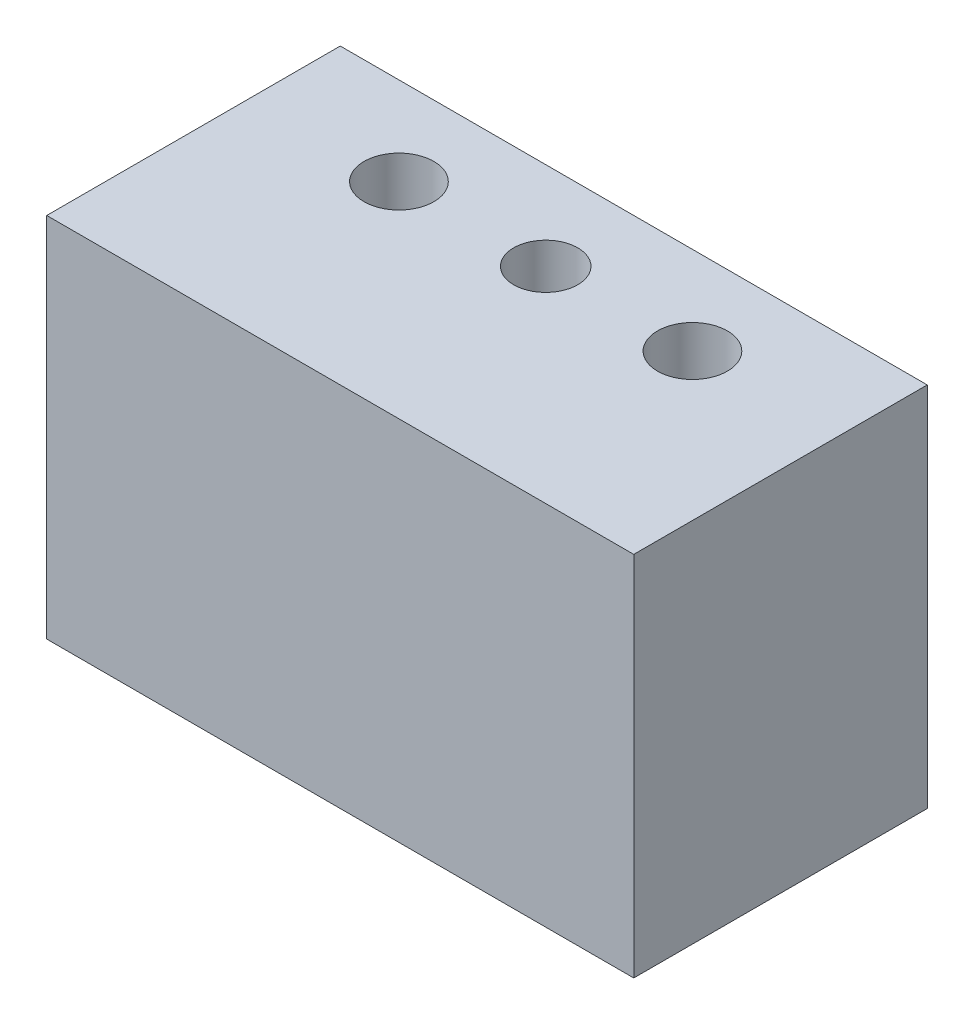
ISO-10303-21;
HEADER;
FILE_DESCRIPTION(('STEP AP214'),'2;1');
FILE_NAME('part.step','',(''),(''),'','','');
FILE_SCHEMA(('AUTOMOTIVE_DESIGN { 1 0 10303 214 1 1 1 1 }'));
ENDSEC;
DATA;
#1=APPLICATION_CONTEXT('core data for automotive mechanical design processes');
#2=APPLICATION_PROTOCOL_DEFINITION('international standard','automotive_design',2000,#1);
#3=PRODUCT_CONTEXT('',#1,'mechanical');
#4=PRODUCT('Part','Part','',(#3));
#5=PRODUCT_RELATED_PRODUCT_CATEGORY('part','',(#4));
#6=PRODUCT_DEFINITION_FORMATION('','',#4);
#7=PRODUCT_DEFINITION_CONTEXT('part definition',#1,'design');
#8=PRODUCT_DEFINITION('design','',#6,#7);
#9=PRODUCT_DEFINITION_SHAPE('','',#8);
#10=(LENGTH_UNIT() NAMED_UNIT(*) SI_UNIT(.MILLI.,.METRE.));
#11=(NAMED_UNIT(*) PLANE_ANGLE_UNIT() SI_UNIT($,.RADIAN.));
#12=(NAMED_UNIT(*) SI_UNIT($,.STERADIAN.) SOLID_ANGLE_UNIT());
#13=UNCERTAINTY_MEASURE_WITH_UNIT(LENGTH_MEASURE(1.E-05),#10,'distance_accuracy_value','');
#14=(GEOMETRIC_REPRESENTATION_CONTEXT(3) GLOBAL_UNCERTAINTY_ASSIGNED_CONTEXT((#13)) GLOBAL_UNIT_ASSIGNED_CONTEXT((#10,
#11,#12)) REPRESENTATION_CONTEXT('',''));
#15=CARTESIAN_POINT('',(0.,0.,0.));
#16=DIRECTION('',(0.,0.,1.));
#17=DIRECTION('',(1.,0.,0.));
#18=AXIS2_PLACEMENT_3D('',#15,#16,#17);
#19=CARTESIAN_POINT('',(0.,25.,0.));
#20=DIRECTION('',(0.,-1.,0.));
#21=DIRECTION('',(0.,0.,-1.));
#22=AXIS2_PLACEMENT_3D('',#19,#20,#21);
#23=PLANE('',#22);
#24=CARTESIAN_POINT('',(20.,25.,-14.));
#25=DIRECTION('',(0.,1.,0.));
#26=DIRECTION('',(0.,0.,1.));
#27=AXIS2_PLACEMENT_3D('',#24,#25,#26);
#28=CIRCLE('',#27,2.18287599999999);
#29=CARTESIAN_POINT('',(20.,25.,-11.817124));
#30=VERTEX_POINT('',#29);
#31=EDGE_CURVE('E128',#30,#30,#28,.T.);
#32=ORIENTED_EDGE('',*,*,#31,.F.);
#33=EDGE_LOOP('',(#32));
#34=FACE_BOUND('',#33,.T.);
#35=CARTESIAN_POINT('',(10.,25.,-14.));
#36=DIRECTION('',(0.,1.,0.));
#37=DIRECTION('',(0.,0.,1.));
#38=AXIS2_PLACEMENT_3D('',#35,#36,#37);
#39=CIRCLE('',#38,2.38);
#40=CARTESIAN_POINT('',(10.,25.,-11.62));
#41=VERTEX_POINT('',#40);
#42=EDGE_CURVE('E102',#41,#41,#39,.T.);
#43=ORIENTED_EDGE('',*,*,#42,.F.);
#44=EDGE_LOOP('',(#43));
#45=FACE_BOUND('',#44,.T.);
#46=DIRECTION('',(0.,0.,1.));
#47=VECTOR('',#46,1.);
#48=CARTESIAN_POINT('',(0.,25.,0.));
#49=LINE('',#48,#47);
#50=CARTESIAN_POINT('',(0.,25.,-20.));
#51=VERTEX_POINT('',#50);
#52=CARTESIAN_POINT('',(0.,25.,0.));
#53=VERTEX_POINT('',#52);
#54=EDGE_CURVE('E87',#51,#53,#49,.T.);
#55=ORIENTED_EDGE('',*,*,#54,.T.);
#56=DIRECTION('',(1.,0.,0.));
#57=VECTOR('',#56,1.);
#58=CARTESIAN_POINT('',(0.,25.,0.));
#59=LINE('',#58,#57);
#60=CARTESIAN_POINT('',(40.,25.,0.));
#61=VERTEX_POINT('',#60);
#62=EDGE_CURVE('E82',#53,#61,#59,.T.);
#63=ORIENTED_EDGE('',*,*,#62,.T.);
#64=DIRECTION('',(0.,0.,-1.));
#65=VECTOR('',#64,1.);
#66=CARTESIAN_POINT('',(40.,25.,0.));
#67=LINE('',#66,#65);
#68=CARTESIAN_POINT('',(40.,25.,-20.));
#69=VERTEX_POINT('',#68);
#70=EDGE_CURVE('E85',#61,#69,#67,.T.);
#71=ORIENTED_EDGE('',*,*,#70,.T.);
#72=DIRECTION('',(-1.,0.,0.));
#73=VECTOR('',#72,1.);
#74=CARTESIAN_POINT('',(0.,25.,-20.));
#75=LINE('',#74,#73);
#76=EDGE_CURVE('E52',#69,#51,#75,.T.);
#77=ORIENTED_EDGE('',*,*,#76,.T.);
#78=EDGE_LOOP('',(#55,#63,#71,#77));
#79=FACE_BOUND('',#78,.T.);
#80=CARTESIAN_POINT('',(30.,25.,-14.));
#81=DIRECTION('',(0.,1.,0.));
#82=DIRECTION('',(0.,0.,1.));
#83=AXIS2_PLACEMENT_3D('',#80,#81,#82);
#84=CIRCLE('',#83,2.38);
#85=CARTESIAN_POINT('',(30.,25.,-11.62));
#86=VERTEX_POINT('',#85);
#87=EDGE_CURVE('E117',#86,#86,#84,.T.);
#88=ORIENTED_EDGE('',*,*,#87,.F.);
#89=EDGE_LOOP('',(#88));
#90=FACE_BOUND('',#89,.T.);
#91=ADVANCED_FACE('F35',(#34,#45,#79,#90),#23,.F.);
#92=CARTESIAN_POINT('',(0.,0.,0.));
#93=DIRECTION('',(0.,-1.,0.));
#94=DIRECTION('',(0.,0.,-1.));
#95=AXIS2_PLACEMENT_3D('',#92,#93,#94);
#96=PLANE('',#95);
#97=CARTESIAN_POINT('',(20.,0.,-14.));
#98=DIRECTION('',(0.,1.,0.));
#99=DIRECTION('',(0.,0.,1.));
#100=AXIS2_PLACEMENT_3D('',#97,#98,#99);
#101=CIRCLE('',#100,2.182876);
#102=CARTESIAN_POINT('',(20.,0.,-11.817124));
#103=VERTEX_POINT('',#102);
#104=EDGE_CURVE('E123',#103,#103,#101,.T.);
#105=ORIENTED_EDGE('',*,*,#104,.T.);
#106=EDGE_LOOP('',(#105));
#107=FACE_BOUND('',#106,.T.);
#108=CARTESIAN_POINT('',(10.,0.,-14.));
#109=DIRECTION('',(0.,1.,0.));
#110=DIRECTION('',(0.,0.,1.));
#111=AXIS2_PLACEMENT_3D('',#108,#109,#110);
#112=CIRCLE('',#111,2.38);
#113=CARTESIAN_POINT('',(10.,0.,-11.62));
#114=VERTEX_POINT('',#113);
#115=EDGE_CURVE('E114',#114,#114,#112,.T.);
#116=ORIENTED_EDGE('',*,*,#115,.T.);
#117=EDGE_LOOP('',(#116));
#118=FACE_BOUND('',#117,.T.);
#119=DIRECTION('',(0.,0.,1.));
#120=VECTOR('',#119,1.);
#121=CARTESIAN_POINT('',(0.,0.,0.));
#122=LINE('',#121,#120);
#123=CARTESIAN_POINT('',(0.,0.,-20.));
#124=VERTEX_POINT('',#123);
#125=CARTESIAN_POINT('',(0.,0.,0.));
#126=VERTEX_POINT('',#125);
#127=EDGE_CURVE('E99',#124,#126,#122,.T.);
#128=ORIENTED_EDGE('',*,*,#127,.F.);
#129=DIRECTION('',(-1.,0.,0.));
#130=VECTOR('',#129,1.);
#131=CARTESIAN_POINT('',(0.,0.,-20.));
#132=LINE('',#131,#130);
#133=CARTESIAN_POINT('',(40.,0.,-20.));
#134=VERTEX_POINT('',#133);
#135=EDGE_CURVE('E75',#134,#124,#132,.T.);
#136=ORIENTED_EDGE('',*,*,#135,.F.);
#137=DIRECTION('',(0.,0.,-1.));
#138=VECTOR('',#137,1.);
#139=CARTESIAN_POINT('',(40.,0.,0.));
#140=LINE('',#139,#138);
#141=CARTESIAN_POINT('',(40.,0.,0.));
#142=VERTEX_POINT('',#141);
#143=EDGE_CURVE('E69',#142,#134,#140,.T.);
#144=ORIENTED_EDGE('',*,*,#143,.F.);
#145=DIRECTION('',(1.,0.,0.));
#146=VECTOR('',#145,1.);
#147=CARTESIAN_POINT('',(0.,0.,0.));
#148=LINE('',#147,#146);
#149=EDGE_CURVE('E91',#126,#142,#148,.T.);
#150=ORIENTED_EDGE('',*,*,#149,.F.);
#151=EDGE_LOOP('',(#128,#136,#144,#150));
#152=FACE_BOUND('',#151,.T.);
#153=CARTESIAN_POINT('',(30.,0.,-14.));
#154=DIRECTION('',(0.,1.,0.));
#155=DIRECTION('',(0.,0.,1.));
#156=AXIS2_PLACEMENT_3D('',#153,#154,#155);
#157=CIRCLE('',#156,2.38);
#158=CARTESIAN_POINT('',(30.,0.,-11.62));
#159=VERTEX_POINT('',#158);
#160=EDGE_CURVE('E120',#159,#159,#157,.T.);
#161=ORIENTED_EDGE('',*,*,#160,.T.);
#162=EDGE_LOOP('',(#161));
#163=FACE_BOUND('',#162,.T.);
#164=ADVANCED_FACE('F110',(#107,#118,#152,#163),#96,.T.);
#165=CARTESIAN_POINT('',(0.,25.,0.));
#166=DIRECTION('',(1.,0.,0.));
#167=DIRECTION('',(0.,0.,-1.));
#168=AXIS2_PLACEMENT_3D('',#165,#166,#167);
#169=PLANE('',#168);
#170=ORIENTED_EDGE('',*,*,#127,.T.);
#171=DIRECTION('',(0.,-1.,0.));
#172=VECTOR('',#171,1.);
#173=CARTESIAN_POINT('',(0.,25.,0.));
#174=LINE('',#173,#172);
#175=EDGE_CURVE('E11',#53,#126,#174,.T.);
#176=ORIENTED_EDGE('',*,*,#175,.F.);
#177=ORIENTED_EDGE('',*,*,#54,.F.);
#178=DIRECTION('',(0.,-1.,0.));
#179=VECTOR('',#178,1.);
#180=CARTESIAN_POINT('',(0.,25.,-20.));
#181=LINE('',#180,#179);
#182=EDGE_CURVE('E95',#51,#124,#181,.T.);
#183=ORIENTED_EDGE('',*,*,#182,.T.);
#184=EDGE_LOOP('',(#170,#176,#177,#183));
#185=FACE_BOUND('',#184,.T.);
#186=ADVANCED_FACE('F37',(#185),#169,.F.);
#187=CARTESIAN_POINT('',(0.,25.,0.));
#188=DIRECTION('',(0.,0.,-1.));
#189=DIRECTION('',(-1.,0.,0.));
#190=AXIS2_PLACEMENT_3D('',#187,#188,#189);
#191=PLANE('',#190);
#192=ORIENTED_EDGE('',*,*,#149,.T.);
#193=DIRECTION('',(0.,-1.,0.));
#194=VECTOR('',#193,1.);
#195=CARTESIAN_POINT('',(40.,25.,0.));
#196=LINE('',#195,#194);
#197=EDGE_CURVE('E44',#61,#142,#196,.T.);
#198=ORIENTED_EDGE('',*,*,#197,.F.);
#199=ORIENTED_EDGE('',*,*,#62,.F.);
#200=ORIENTED_EDGE('',*,*,#175,.T.);
#201=EDGE_LOOP('',(#192,#198,#199,#200));
#202=FACE_BOUND('',#201,.T.);
#203=ADVANCED_FACE('F90',(#202),#191,.F.);
#204=CARTESIAN_POINT('',(40.,25.,0.));
#205=DIRECTION('',(-1.,0.,0.));
#206=DIRECTION('',(0.,0.,1.));
#207=AXIS2_PLACEMENT_3D('',#204,#205,#206);
#208=PLANE('',#207);
#209=ORIENTED_EDGE('',*,*,#143,.T.);
#210=DIRECTION('',(0.,-1.,0.));
#211=VECTOR('',#210,1.);
#212=CARTESIAN_POINT('',(40.,25.,-20.));
#213=LINE('',#212,#211);
#214=EDGE_CURVE('E92',#69,#134,#213,.T.);
#215=ORIENTED_EDGE('',*,*,#214,.F.);
#216=ORIENTED_EDGE('',*,*,#70,.F.);
#217=ORIENTED_EDGE('',*,*,#197,.T.);
#218=EDGE_LOOP('',(#209,#215,#216,#217));
#219=FACE_BOUND('',#218,.T.);
#220=ADVANCED_FACE('F93',(#219),#208,.F.);
#221=CARTESIAN_POINT('',(0.,25.,-20.));
#222=DIRECTION('',(0.,0.,1.));
#223=DIRECTION('',(1.,0.,0.));
#224=AXIS2_PLACEMENT_3D('',#221,#222,#223);
#225=PLANE('',#224);
#226=ORIENTED_EDGE('',*,*,#135,.T.);
#227=ORIENTED_EDGE('',*,*,#182,.F.);
#228=ORIENTED_EDGE('',*,*,#76,.F.);
#229=ORIENTED_EDGE('',*,*,#214,.T.);
#230=EDGE_LOOP('',(#226,#227,#228,#229));
#231=FACE_BOUND('',#230,.T.);
#232=ADVANCED_FACE('F107',(#231),#225,.F.);
#233=CARTESIAN_POINT('',(10.,25.,-14.));
#234=DIRECTION('',(0.,-1.,0.));
#235=DIRECTION('',(0.,0.,-1.));
#236=AXIS2_PLACEMENT_3D('',#233,#234,#235);
#237=CYLINDRICAL_SURFACE('',#236,2.38);
#238=ORIENTED_EDGE('',*,*,#42,.T.);
#239=EDGE_LOOP('',(#238));
#240=FACE_BOUND('',#239,.T.);
#241=ORIENTED_EDGE('',*,*,#115,.F.);
#242=EDGE_LOOP('',(#241));
#243=FACE_BOUND('',#242,.T.);
#244=ADVANCED_FACE('F139',(#240,#243),#237,.F.);
#245=CARTESIAN_POINT('',(30.,25.,-14.));
#246=DIRECTION('',(0.,-1.,0.));
#247=DIRECTION('',(0.,0.,-1.));
#248=AXIS2_PLACEMENT_3D('',#245,#246,#247);
#249=CYLINDRICAL_SURFACE('',#248,2.38);
#250=ORIENTED_EDGE('',*,*,#87,.T.);
#251=EDGE_LOOP('',(#250));
#252=FACE_BOUND('',#251,.T.);
#253=ORIENTED_EDGE('',*,*,#160,.F.);
#254=EDGE_LOOP('',(#253));
#255=FACE_BOUND('',#254,.T.);
#256=ADVANCED_FACE('F142',(#252,#255),#249,.F.);
#257=CARTESIAN_POINT('',(20.,25.,-14.));
#258=DIRECTION('',(0.,1.,0.));
#259=DIRECTION('',(0.,0.,1.));
#260=AXIS2_PLACEMENT_3D('',#257,#258,#259);
#261=CYLINDRICAL_SURFACE('',#260,2.18287599999999);
#262=ORIENTED_EDGE('',*,*,#104,.F.);
#263=EDGE_LOOP('',(#262));
#264=FACE_BOUND('',#263,.T.);
#265=ORIENTED_EDGE('',*,*,#31,.T.);
#266=EDGE_LOOP('',(#265));
#267=FACE_BOUND('',#266,.T.);
#268=ADVANCED_FACE('F132',(#264,#267),#261,.F.);
#269=CLOSED_SHELL('',(#91,#164,#186,#203,#220,#232,#244,#256,#268));
#270=MANIFOLD_SOLID_BREP('B2',#269);
#271=ADVANCED_BREP_SHAPE_REPRESENTATION('',(#18,#270),#14);
#272=SHAPE_DEFINITION_REPRESENTATION(#9,#271);
ENDSEC;
END-ISO-10303-21;
